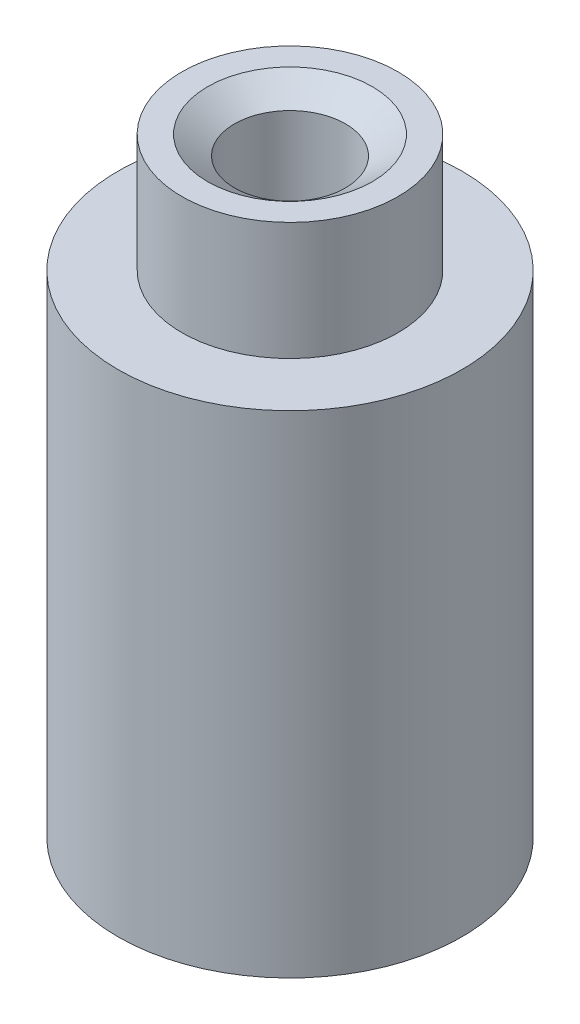
ISO-10303-21;
HEADER;
FILE_DESCRIPTION(('STEP AP214'),'2;1');
FILE_NAME('part.step','',(''),(''),'','','');
FILE_SCHEMA(('AUTOMOTIVE_DESIGN { 1 0 10303 214 1 1 1 1 }'));
ENDSEC;
DATA;
#1=APPLICATION_CONTEXT('core data for automotive mechanical design processes');
#2=APPLICATION_PROTOCOL_DEFINITION('international standard','automotive_design',2000,#1);
#3=PRODUCT_CONTEXT('',#1,'mechanical');
#4=PRODUCT('Part','Part','',(#3));
#5=PRODUCT_RELATED_PRODUCT_CATEGORY('part','',(#4));
#6=PRODUCT_DEFINITION_FORMATION('','',#4);
#7=PRODUCT_DEFINITION_CONTEXT('part definition',#1,'design');
#8=PRODUCT_DEFINITION('design','',#6,#7);
#9=PRODUCT_DEFINITION_SHAPE('','',#8);
#10=(LENGTH_UNIT() NAMED_UNIT(*) SI_UNIT(.MILLI.,.METRE.));
#11=(NAMED_UNIT(*) PLANE_ANGLE_UNIT() SI_UNIT($,.RADIAN.));
#12=(NAMED_UNIT(*) SI_UNIT($,.STERADIAN.) SOLID_ANGLE_UNIT());
#13=UNCERTAINTY_MEASURE_WITH_UNIT(LENGTH_MEASURE(1.E-05),#10,'distance_accuracy_value','');
#14=(GEOMETRIC_REPRESENTATION_CONTEXT(3) GLOBAL_UNCERTAINTY_ASSIGNED_CONTEXT((#13)) GLOBAL_UNIT_ASSIGNED_CONTEXT((#10,
#11,#12)) REPRESENTATION_CONTEXT('',''));
#15=CARTESIAN_POINT('',(0.,0.,0.));
#16=DIRECTION('',(0.,0.,1.));
#17=DIRECTION('',(1.,0.,0.));
#18=AXIS2_PLACEMENT_3D('',#15,#16,#17);
#19=CARTESIAN_POINT('',(0.,0.,-3.5));
#20=DIRECTION('',(0.,-1.,0.));
#21=DIRECTION('',(0.,0.,-1.));
#22=AXIS2_PLACEMENT_3D('',#19,#20,#21);
#23=PLANE('',#22);
#24=CARTESIAN_POINT('',(0.,0.,0.));
#25=DIRECTION('',(0.,-1.,0.));
#26=DIRECTION('',(0.,0.,-1.));
#27=AXIS2_PLACEMENT_3D('',#24,#25,#26);
#28=CIRCLE('',#27,1.6764);
#29=CARTESIAN_POINT('',(0.,0.,-1.6764));
#30=VERTEX_POINT('',#29);
#31=EDGE_CURVE('E54',#30,#30,#28,.T.);
#32=ORIENTED_EDGE('',*,*,#31,.F.);
#33=EDGE_LOOP('',(#32));
#34=FACE_BOUND('',#33,.T.);
#35=CARTESIAN_POINT('',(0.,0.,0.));
#36=DIRECTION('',(0.,-1.,0.));
#37=DIRECTION('',(0.,0.,-1.));
#38=AXIS2_PLACEMENT_3D('',#35,#36,#37);
#39=CIRCLE('',#38,3.5);
#40=CARTESIAN_POINT('',(0.,0.,-3.5));
#41=VERTEX_POINT('',#40);
#42=EDGE_CURVE('E43',#41,#41,#39,.T.);
#43=ORIENTED_EDGE('',*,*,#42,.T.);
#44=EDGE_LOOP('',(#43));
#45=FACE_BOUND('',#44,.T.);
#46=ADVANCED_FACE('F29',(#34,#45),#23,.T.);
#47=CARTESIAN_POINT('',(0.,12.4,0.));
#48=DIRECTION('',(0.,1.,0.));
#49=DIRECTION('',(0.,0.,1.));
#50=AXIS2_PLACEMENT_3D('',#47,#48,#49);
#51=PLANE('',#50);
#52=CARTESIAN_POINT('',(0.,12.4,0.));
#53=DIRECTION('',(0.,-1.,0.));
#54=DIRECTION('',(0.,0.,-1.));
#55=AXIS2_PLACEMENT_3D('',#52,#53,#54);
#56=CIRCLE('',#55,1.6764);
#57=CARTESIAN_POINT('',(0.,12.4,-1.6764));
#58=VERTEX_POINT('',#57);
#59=EDGE_CURVE('E57',#58,#58,#56,.T.);
#60=ORIENTED_EDGE('',*,*,#59,.T.);
#61=EDGE_LOOP('',(#60));
#62=FACE_BOUND('',#61,.T.);
#63=CARTESIAN_POINT('',(0.,12.4,0.));
#64=DIRECTION('',(0.,-1.,0.));
#65=DIRECTION('',(0.,0.,-1.));
#66=AXIS2_PLACEMENT_3D('',#63,#64,#65);
#67=CIRCLE('',#66,2.2);
#68=CARTESIAN_POINT('',(0.,12.4,-2.2));
#69=VERTEX_POINT('',#68);
#70=EDGE_CURVE('E10',#69,#69,#67,.T.);
#71=ORIENTED_EDGE('',*,*,#70,.F.);
#72=EDGE_LOOP('',(#71));
#73=FACE_BOUND('',#72,.T.);
#74=ADVANCED_FACE('F61',(#62,#73),#51,.T.);
#75=CARTESIAN_POINT('',(0.,0.,0.));
#76=DIRECTION('',(0.,-1.,0.));
#77=DIRECTION('',(0.,0.,-1.));
#78=AXIS2_PLACEMENT_3D('',#75,#76,#77);
#79=CYLINDRICAL_SURFACE('',#78,2.2);
#80=ORIENTED_EDGE('',*,*,#70,.T.);
#81=EDGE_LOOP('',(#80));
#82=FACE_BOUND('',#81,.T.);
#83=CARTESIAN_POINT('',(0.,10.,0.));
#84=DIRECTION('',(0.,-1.,0.));
#85=DIRECTION('',(0.,0.,-1.));
#86=AXIS2_PLACEMENT_3D('',#83,#84,#85);
#87=CIRCLE('',#86,2.2);
#88=CARTESIAN_POINT('',(0.,10.,-2.2));
#89=VERTEX_POINT('',#88);
#90=EDGE_CURVE('E35',#89,#89,#87,.T.);
#91=ORIENTED_EDGE('',*,*,#90,.F.);
#92=EDGE_LOOP('',(#91));
#93=FACE_BOUND('',#92,.T.);
#94=ADVANCED_FACE('F94',(#82,#93),#79,.T.);
#95=CARTESIAN_POINT('',(0.,10.,-2.2));
#96=DIRECTION('',(0.,1.,0.));
#97=DIRECTION('',(0.,0.,1.));
#98=AXIS2_PLACEMENT_3D('',#95,#96,#97);
#99=PLANE('',#98);
#100=ORIENTED_EDGE('',*,*,#90,.T.);
#101=EDGE_LOOP('',(#100));
#102=FACE_BOUND('',#101,.T.);
#103=CARTESIAN_POINT('',(0.,10.,0.));
#104=DIRECTION('',(0.,-1.,0.));
#105=DIRECTION('',(0.,0.,-1.));
#106=AXIS2_PLACEMENT_3D('',#103,#104,#105);
#107=CIRCLE('',#106,3.5);
#108=CARTESIAN_POINT('',(0.,10.,-3.5));
#109=VERTEX_POINT('',#108);
#110=EDGE_CURVE('E39',#109,#109,#107,.T.);
#111=ORIENTED_EDGE('',*,*,#110,.F.);
#112=EDGE_LOOP('',(#111));
#113=FACE_BOUND('',#112,.T.);
#114=ADVANCED_FACE('F88',(#102,#113),#99,.T.);
#115=CARTESIAN_POINT('',(0.,0.,0.));
#116=DIRECTION('',(0.,-1.,0.));
#117=DIRECTION('',(0.,0.,-1.));
#118=AXIS2_PLACEMENT_3D('',#115,#116,#117);
#119=CYLINDRICAL_SURFACE('',#118,3.5);
#120=ORIENTED_EDGE('',*,*,#110,.T.);
#121=EDGE_LOOP('',(#120));
#122=FACE_BOUND('',#121,.T.);
#123=ORIENTED_EDGE('',*,*,#42,.F.);
#124=EDGE_LOOP('',(#123));
#125=FACE_BOUND('',#124,.T.);
#126=ADVANCED_FACE('F68',(#122,#125),#119,.T.);
#127=CARTESIAN_POINT('',(0.,12.0176166633837,0.));
#128=DIRECTION('',(0.,1.,0.));
#129=DIRECTION('',(0.,0.,1.));
#130=AXIS2_PLACEMENT_3D('',#127,#128,#129);
#131=CONICAL_SURFACE('',#130,1.1303,0.959931088596882);
#132=ORIENTED_EDGE('',*,*,#59,.F.);
#133=EDGE_LOOP('',(#132));
#134=FACE_BOUND('',#133,.T.);
#135=CARTESIAN_POINT('',(0.,12.0176166633837,0.));
#136=DIRECTION('',(0.,-1.,0.));
#137=DIRECTION('',(0.,0.,-1.));
#138=AXIS2_PLACEMENT_3D('',#135,#136,#137);
#139=CIRCLE('',#138,1.1303);
#140=CARTESIAN_POINT('',(0.,12.0176166633837,-1.1303));
#141=VERTEX_POINT('',#140);
#142=EDGE_CURVE('E48',#141,#141,#139,.T.);
#143=ORIENTED_EDGE('',*,*,#142,.T.);
#144=EDGE_LOOP('',(#143));
#145=FACE_BOUND('',#144,.T.);
#146=ADVANCED_FACE('F64',(#134,#145),#131,.F.);
#147=CARTESIAN_POINT('',(0.,0.,0.));
#148=DIRECTION('',(0.,-1.,0.));
#149=DIRECTION('',(0.,0.,-1.));
#150=AXIS2_PLACEMENT_3D('',#147,#148,#149);
#151=CYLINDRICAL_SURFACE('',#150,1.1303);
#152=ORIENTED_EDGE('',*,*,#142,.F.);
#153=EDGE_LOOP('',(#152));
#154=FACE_BOUND('',#153,.T.);
#155=CARTESIAN_POINT('',(0.,0.382383336616322,0.));
#156=DIRECTION('',(0.,-1.,0.));
#157=DIRECTION('',(0.,0.,-1.));
#158=AXIS2_PLACEMENT_3D('',#155,#156,#157);
#159=CIRCLE('',#158,1.1303);
#160=CARTESIAN_POINT('',(0.,0.382383336616322,-1.1303));
#161=VERTEX_POINT('',#160);
#162=EDGE_CURVE('E51',#161,#161,#159,.T.);
#163=ORIENTED_EDGE('',*,*,#162,.T.);
#164=EDGE_LOOP('',(#163));
#165=FACE_BOUND('',#164,.T.);
#166=ADVANCED_FACE('F67',(#154,#165),#151,.F.);
#167=CARTESIAN_POINT('',(0.,0.,0.));
#168=DIRECTION('',(0.,-1.,0.));
#169=DIRECTION('',(0.,0.,-1.));
#170=AXIS2_PLACEMENT_3D('',#167,#168,#169);
#171=CONICAL_SURFACE('',#170,1.6764,0.95993108859688);
#172=ORIENTED_EDGE('',*,*,#162,.F.);
#173=EDGE_LOOP('',(#172));
#174=FACE_BOUND('',#173,.T.);
#175=ORIENTED_EDGE('',*,*,#31,.T.);
#176=EDGE_LOOP('',(#175));
#177=FACE_BOUND('',#176,.T.);
#178=ADVANCED_FACE('F74',(#174,#177),#171,.F.);
#179=CLOSED_SHELL('',(#46,#74,#94,#114,#126,#146,#166,#178));
#180=MANIFOLD_SOLID_BREP('B2',#179);
#181=ADVANCED_BREP_SHAPE_REPRESENTATION('',(#18,#180),#14);
#182=SHAPE_DEFINITION_REPRESENTATION(#9,#181);
ENDSEC;
END-ISO-10303-21;
